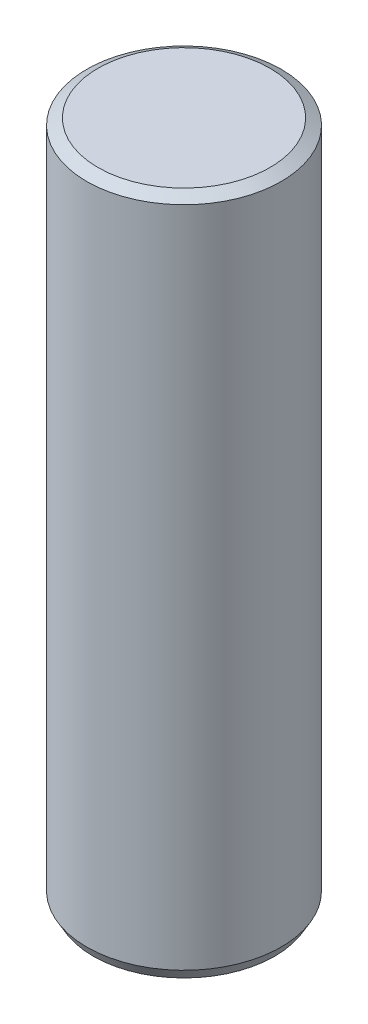
ISO-10303-21;
HEADER;
FILE_DESCRIPTION(('STEP AP214'),'2;1');
FILE_NAME('part.step','',(''),(''),'','','');
FILE_SCHEMA(('AUTOMOTIVE_DESIGN { 1 0 10303 214 1 1 1 1 }'));
ENDSEC;
DATA;
#1=APPLICATION_CONTEXT('core data for automotive mechanical design processes');
#2=APPLICATION_PROTOCOL_DEFINITION('international standard','automotive_design',2000,#1);
#3=PRODUCT_CONTEXT('',#1,'mechanical');
#4=PRODUCT('Part','Part','',(#3));
#5=PRODUCT_RELATED_PRODUCT_CATEGORY('part','',(#4));
#6=PRODUCT_DEFINITION_FORMATION('','',#4);
#7=PRODUCT_DEFINITION_CONTEXT('part definition',#1,'design');
#8=PRODUCT_DEFINITION('design','',#6,#7);
#9=PRODUCT_DEFINITION_SHAPE('','',#8);
#10=(LENGTH_UNIT() NAMED_UNIT(*) SI_UNIT(.MILLI.,.METRE.));
#11=(NAMED_UNIT(*) PLANE_ANGLE_UNIT() SI_UNIT($,.RADIAN.));
#12=(NAMED_UNIT(*) SI_UNIT($,.STERADIAN.) SOLID_ANGLE_UNIT());
#13=UNCERTAINTY_MEASURE_WITH_UNIT(LENGTH_MEASURE(1.E-05),#10,'distance_accuracy_value','');
#14=(GEOMETRIC_REPRESENTATION_CONTEXT(3) GLOBAL_UNCERTAINTY_ASSIGNED_CONTEXT((#13)) GLOBAL_UNIT_ASSIGNED_CONTEXT((#10,
#11,#12)) REPRESENTATION_CONTEXT('',''));
#15=CARTESIAN_POINT('',(0.,0.,0.));
#16=DIRECTION('',(0.,0.,1.));
#17=DIRECTION('',(1.,0.,0.));
#18=AXIS2_PLACEMENT_3D('',#15,#16,#17);
#19=CARTESIAN_POINT('',(0.,10.5,0.));
#20=DIRECTION('',(0.,-1.,0.));
#21=DIRECTION('',(0.,0.,-1.));
#22=AXIS2_PLACEMENT_3D('',#19,#20,#21);
#23=PLANE('',#22);
#24=CARTESIAN_POINT('',(0.,10.5,0.));
#25=DIRECTION('',(0.,-1.,0.));
#26=DIRECTION('',(0.,0.,-1.));
#27=AXIS2_PLACEMENT_3D('',#24,#25,#26);
#28=CIRCLE('',#27,2.65358983848623);
#29=CARTESIAN_POINT('',(0.,10.5,-2.65358983848623));
#30=VERTEX_POINT('',#29);
#31=EDGE_CURVE('E9',#30,#30,#28,.F.);
#32=ORIENTED_EDGE('',*,*,#31,.T.);
#33=EDGE_LOOP('',(#32));
#34=FACE_BOUND('',#33,.T.);
#35=ADVANCED_FACE('F14',(#34),#23,.F.);
#36=CARTESIAN_POINT('',(0.,54.8715946843854,0.));
#37=DIRECTION('',(0.,1.,0.));
#38=DIRECTION('',(0.,0.,1.));
#39=AXIS2_PLACEMENT_3D('',#36,#37,#38);
#40=CYLINDRICAL_SURFACE('',#39,3.);
#41=CARTESIAN_POINT('',(0.,-10.1535898384862,0.));
#42=DIRECTION('',(0.,1.,0.));
#43=DIRECTION('',(0.,0.,1.));
#44=AXIS2_PLACEMENT_3D('',#41,#42,#43);
#45=CIRCLE('',#44,3.);
#46=CARTESIAN_POINT('',(0.,-10.1535898384862,3.));
#47=VERTEX_POINT('',#46);
#48=EDGE_CURVE('E25',#47,#47,#45,.T.);
#49=ORIENTED_EDGE('',*,*,#48,.T.);
#50=EDGE_LOOP('',(#49));
#51=FACE_BOUND('',#50,.T.);
#52=CARTESIAN_POINT('',(0.,10.3,0.));
#53=DIRECTION('',(0.,-1.,0.));
#54=DIRECTION('',(0.,0.,-1.));
#55=AXIS2_PLACEMENT_3D('',#52,#53,#54);
#56=CIRCLE('',#55,3.);
#57=CARTESIAN_POINT('',(0.,10.3,-3.));
#58=VERTEX_POINT('',#57);
#59=EDGE_CURVE('E29',#58,#58,#56,.T.);
#60=ORIENTED_EDGE('',*,*,#59,.T.);
#61=EDGE_LOOP('',(#60));
#62=FACE_BOUND('',#61,.T.);
#63=ADVANCED_FACE('F35',(#51,#62),#40,.T.);
#64=CARTESIAN_POINT('',(3.,-10.5,0.));
#65=DIRECTION('',(0.,1.,0.));
#66=DIRECTION('',(0.,0.,1.));
#67=AXIS2_PLACEMENT_3D('',#64,#65,#66);
#68=PLANE('',#67);
#69=CARTESIAN_POINT('',(0.,-10.5,0.));
#70=DIRECTION('',(0.,1.,0.));
#71=DIRECTION('',(0.,0.,1.));
#72=AXIS2_PLACEMENT_3D('',#69,#70,#71);
#73=CIRCLE('',#72,2.8);
#74=CARTESIAN_POINT('',(0.,-10.5,2.8));
#75=VERTEX_POINT('',#74);
#76=EDGE_CURVE('E21',#75,#75,#73,.F.);
#77=ORIENTED_EDGE('',*,*,#76,.T.);
#78=EDGE_LOOP('',(#77));
#79=FACE_BOUND('',#78,.T.);
#80=ADVANCED_FACE('F45',(#79),#68,.F.);
#81=CARTESIAN_POINT('',(0.,-10.1535898384862,0.));
#82=DIRECTION('',(0.,1.,0.));
#83=DIRECTION('',(0.,0.,1.));
#84=AXIS2_PLACEMENT_3D('',#81,#82,#83);
#85=CONICAL_SURFACE('',#84,3.,0.523598775598299);
#86=ORIENTED_EDGE('',*,*,#76,.F.);
#87=EDGE_LOOP('',(#86));
#88=FACE_BOUND('',#87,.T.);
#89=ORIENTED_EDGE('',*,*,#48,.F.);
#90=EDGE_LOOP('',(#89));
#91=FACE_BOUND('',#90,.T.);
#92=ADVANCED_FACE('F39',(#88,#91),#85,.T.);
#93=CARTESIAN_POINT('',(0.,10.5,0.));
#94=DIRECTION('',(0.,-1.,0.));
#95=DIRECTION('',(0.,0.,-1.));
#96=AXIS2_PLACEMENT_3D('',#93,#94,#95);
#97=CONICAL_SURFACE('',#96,2.65358983848623,1.0471975511966);
#98=ORIENTED_EDGE('',*,*,#59,.F.);
#99=EDGE_LOOP('',(#98));
#100=FACE_BOUND('',#99,.T.);
#101=ORIENTED_EDGE('',*,*,#31,.F.);
#102=EDGE_LOOP('',(#101));
#103=FACE_BOUND('',#102,.T.);
#104=ADVANCED_FACE('F16',(#100,#103),#97,.T.);
#105=CLOSED_SHELL('',(#35,#63,#80,#92,#104));
#106=MANIFOLD_SOLID_BREP('B1',#105);
#107=ADVANCED_BREP_SHAPE_REPRESENTATION('',(#18,#106),#14);
#108=SHAPE_DEFINITION_REPRESENTATION(#9,#107);
ENDSEC;
END-ISO-10303-21;
